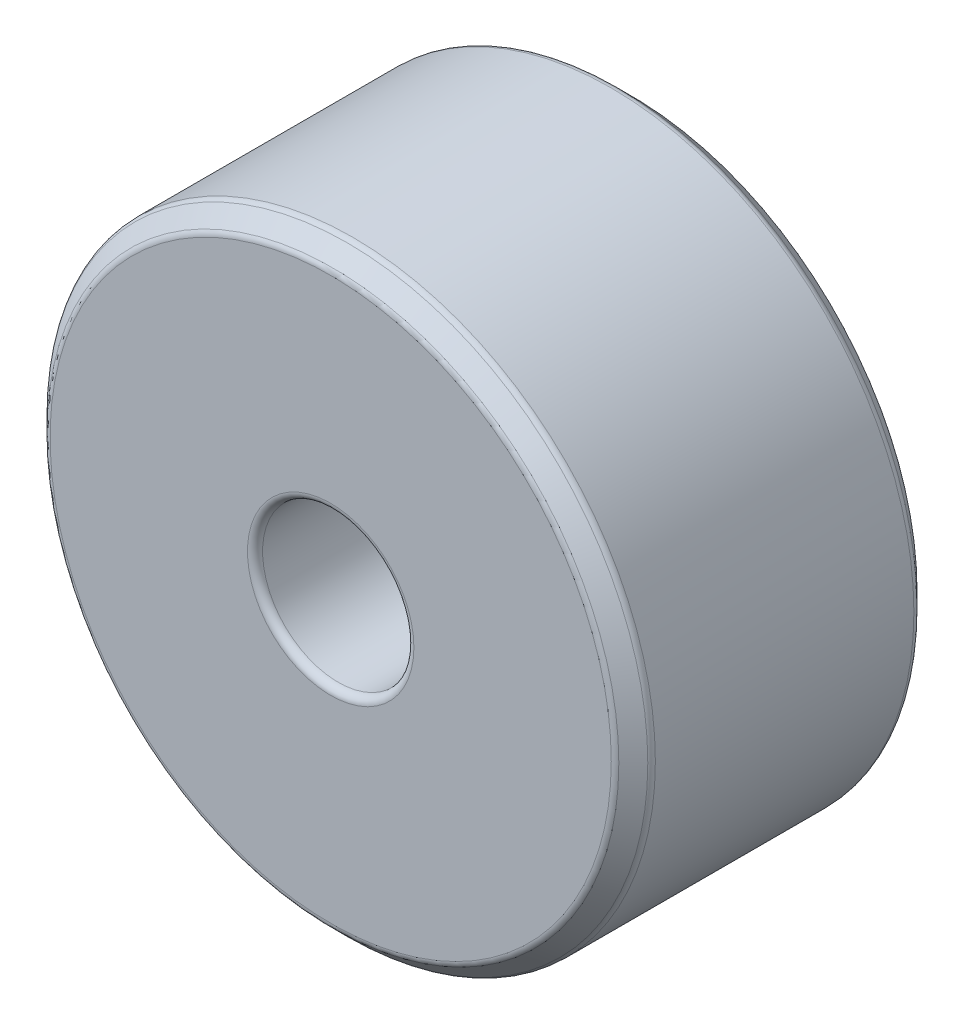
ISO-10303-21;
HEADER;
FILE_DESCRIPTION(('STEP AP214'),'2;1');
FILE_NAME('part.step','',(''),(''),'','','');
FILE_SCHEMA(('AUTOMOTIVE_DESIGN { 1 0 10303 214 1 1 1 1 }'));
ENDSEC;
DATA;
#1=APPLICATION_CONTEXT('core data for automotive mechanical design processes');
#2=APPLICATION_PROTOCOL_DEFINITION('international standard','automotive_design',2000,#1);
#3=PRODUCT_CONTEXT('',#1,'mechanical');
#4=PRODUCT('Part','Part','',(#3));
#5=PRODUCT_RELATED_PRODUCT_CATEGORY('part','',(#4));
#6=PRODUCT_DEFINITION_FORMATION('','',#4);
#7=PRODUCT_DEFINITION_CONTEXT('part definition',#1,'design');
#8=PRODUCT_DEFINITION('design','',#6,#7);
#9=PRODUCT_DEFINITION_SHAPE('','',#8);
#10=(LENGTH_UNIT() NAMED_UNIT(*) SI_UNIT(.MILLI.,.METRE.));
#11=(NAMED_UNIT(*) PLANE_ANGLE_UNIT() SI_UNIT($,.RADIAN.));
#12=(NAMED_UNIT(*) SI_UNIT($,.STERADIAN.) SOLID_ANGLE_UNIT());
#13=UNCERTAINTY_MEASURE_WITH_UNIT(LENGTH_MEASURE(1.E-05),#10,'distance_accuracy_value','');
#14=(GEOMETRIC_REPRESENTATION_CONTEXT(3) GLOBAL_UNCERTAINTY_ASSIGNED_CONTEXT((#13)) GLOBAL_UNIT_ASSIGNED_CONTEXT((#10,
#11,#12)) REPRESENTATION_CONTEXT('',''));
#15=CARTESIAN_POINT('',(0.,0.,0.));
#16=DIRECTION('',(0.,0.,1.));
#17=DIRECTION('',(1.,0.,0.));
#18=AXIS2_PLACEMENT_3D('',#15,#16,#17);
#19=CARTESIAN_POINT('',(0.,0.,4.));
#20=DIRECTION('',(0.,0.,1.));
#21=DIRECTION('',(1.,0.,0.));
#22=AXIS2_PLACEMENT_3D('',#19,#20,#21);
#23=PLANE('',#22);
#24=CARTESIAN_POINT('',(0.,0.,4.));
#25=DIRECTION('',(0.,0.,1.));
#26=DIRECTION('',(1.,0.,0.));
#27=AXIS2_PLACEMENT_3D('',#24,#25,#26);
#28=CIRCLE('',#27,3.70857864376269);
#29=CARTESIAN_POINT('',(3.70857864376269,0.,4.));
#30=VERTEX_POINT('',#29);
#31=EDGE_CURVE('E53',#30,#30,#28,.T.);
#32=ORIENTED_EDGE('',*,*,#31,.T.);
#33=EDGE_LOOP('',(#32));
#34=FACE_BOUND('',#33,.T.);
#35=CARTESIAN_POINT('',(0.,0.,4.));
#36=DIRECTION('',(0.,0.,1.));
#37=DIRECTION('',(1.,0.,0.));
#38=AXIS2_PLACEMENT_3D('',#35,#36,#37);
#39=CIRCLE('',#38,1.1);
#40=CARTESIAN_POINT('',(1.1,0.,4.));
#41=VERTEX_POINT('',#40);
#42=EDGE_CURVE('E56',#41,#41,#39,.F.);
#43=ORIENTED_EDGE('',*,*,#42,.T.);
#44=EDGE_LOOP('',(#43));
#45=FACE_BOUND('',#44,.T.);
#46=ADVANCED_FACE('F33',(#34,#45),#23,.T.);
#47=CARTESIAN_POINT('',(0.,0.,0.));
#48=DIRECTION('',(0.,0.,1.));
#49=DIRECTION('',(1.,0.,0.));
#50=AXIS2_PLACEMENT_3D('',#47,#48,#49);
#51=PLANE('',#50);
#52=CARTESIAN_POINT('',(0.,0.,0.));
#53=DIRECTION('',(0.,0.,1.));
#54=DIRECTION('',(1.,0.,0.));
#55=AXIS2_PLACEMENT_3D('',#52,#53,#54);
#56=CIRCLE('',#55,3.70857864376269);
#57=CARTESIAN_POINT('',(3.70857864376269,0.,0.));
#58=VERTEX_POINT('',#57);
#59=EDGE_CURVE('E71',#58,#58,#56,.F.);
#60=ORIENTED_EDGE('',*,*,#59,.T.);
#61=EDGE_LOOP('',(#60));
#62=FACE_BOUND('',#61,.T.);
#63=CARTESIAN_POINT('',(0.,0.,0.));
#64=DIRECTION('',(0.,0.,1.));
#65=DIRECTION('',(1.,0.,0.));
#66=AXIS2_PLACEMENT_3D('',#63,#64,#65);
#67=CIRCLE('',#66,1.1);
#68=CARTESIAN_POINT('',(1.1,0.,0.));
#69=VERTEX_POINT('',#68);
#70=EDGE_CURVE('E74',#69,#69,#67,.T.);
#71=ORIENTED_EDGE('',*,*,#70,.T.);
#72=EDGE_LOOP('',(#71));
#73=FACE_BOUND('',#72,.T.);
#74=ADVANCED_FACE('F78',(#62,#73),#51,.F.);
#75=CARTESIAN_POINT('',(0.,0.,4.));
#76=DIRECTION('',(0.,0.,-1.));
#77=DIRECTION('',(-1.,0.,0.));
#78=AXIS2_PLACEMENT_3D('',#75,#76,#77);
#79=CYLINDRICAL_SURFACE('',#78,4.);
#80=CARTESIAN_POINT('',(0.,0.,0.291421356237313));
#81=DIRECTION('',(0.,0.,-1.));
#82=DIRECTION('',(-1.,0.,0.));
#83=AXIS2_PLACEMENT_3D('',#80,#81,#82);
#84=CIRCLE('',#83,4.);
#85=CARTESIAN_POINT('',(-4.,0.,0.291421356237313));
#86=VERTEX_POINT('',#85);
#87=EDGE_CURVE('E59',#86,#86,#84,.F.);
#88=ORIENTED_EDGE('',*,*,#87,.T.);
#89=EDGE_LOOP('',(#88));
#90=FACE_BOUND('',#89,.T.);
#91=CARTESIAN_POINT('',(0.,0.,3.70857864376269));
#92=DIRECTION('',(0.,0.,1.));
#93=DIRECTION('',(1.,0.,0.));
#94=AXIS2_PLACEMENT_3D('',#91,#92,#93);
#95=CIRCLE('',#94,4.);
#96=CARTESIAN_POINT('',(4.,0.,3.70857864376269));
#97=VERTEX_POINT('',#96);
#98=EDGE_CURVE('E62',#97,#97,#95,.F.);
#99=ORIENTED_EDGE('',*,*,#98,.T.);
#100=EDGE_LOOP('',(#99));
#101=FACE_BOUND('',#100,.T.);
#102=ADVANCED_FACE('F98',(#90,#101),#79,.T.);
#103=CARTESIAN_POINT('',(0.,0.,4.));
#104=DIRECTION('',(0.,0.,-1.));
#105=DIRECTION('',(-1.,0.,0.));
#106=AXIS2_PLACEMENT_3D('',#103,#104,#105);
#107=CYLINDRICAL_SURFACE('',#106,1.);
#108=CARTESIAN_POINT('',(0.,0.,0.0999999999999998));
#109=DIRECTION('',(0.,0.,1.));
#110=DIRECTION('',(1.,0.,0.));
#111=AXIS2_PLACEMENT_3D('',#108,#109,#110);
#112=CIRCLE('',#111,1.);
#113=CARTESIAN_POINT('',(1.,0.,0.0999999999999998));
#114=VERTEX_POINT('',#113);
#115=EDGE_CURVE('E10',#114,#114,#112,.F.);
#116=ORIENTED_EDGE('',*,*,#115,.T.);
#117=EDGE_LOOP('',(#116));
#118=FACE_BOUND('',#117,.T.);
#119=CARTESIAN_POINT('',(0.,0.,3.9));
#120=DIRECTION('',(0.,0.,1.));
#121=DIRECTION('',(1.,0.,0.));
#122=AXIS2_PLACEMENT_3D('',#119,#120,#121);
#123=CIRCLE('',#122,1.);
#124=CARTESIAN_POINT('',(1.,0.,3.9));
#125=VERTEX_POINT('',#124);
#126=EDGE_CURVE('E40',#125,#125,#123,.T.);
#127=ORIENTED_EDGE('',*,*,#126,.T.);
#128=EDGE_LOOP('',(#127));
#129=FACE_BOUND('',#128,.T.);
#130=ADVANCED_FACE('F103',(#118,#129),#107,.F.);
#131=CARTESIAN_POINT('',(0.,0.,0.250000000000003));
#132=DIRECTION('',(0.,0.,1.));
#133=DIRECTION('',(1.,0.,0.));
#134=AXIS2_PLACEMENT_3D('',#131,#132,#133);
#135=CONICAL_SURFACE('',#134,4.,0.78539816339745);
#136=CARTESIAN_POINT('',(0.,0.,0.0292893218813441));
#137=DIRECTION('',(0.,0.,1.));
#138=DIRECTION('',(1.,0.,0.));
#139=AXIS2_PLACEMENT_3D('',#136,#137,#138);
#140=CIRCLE('',#139,3.77928932188134);
#141=CARTESIAN_POINT('',(3.77928932188134,0.,0.0292893218813441));
#142=VERTEX_POINT('',#141);
#143=EDGE_CURVE('E65',#142,#142,#140,.T.);
#144=ORIENTED_EDGE('',*,*,#143,.T.);
#145=EDGE_LOOP('',(#144));
#146=FACE_BOUND('',#145,.T.);
#147=CARTESIAN_POINT('',(0.,0.,0.220710678118658));
#148=DIRECTION('',(0.,0.,1.));
#149=DIRECTION('',(1.,0.,0.));
#150=AXIS2_PLACEMENT_3D('',#147,#148,#149);
#151=CIRCLE('',#150,3.97071067811865);
#152=CARTESIAN_POINT('',(3.97071067811865,0.,0.220710678118658));
#153=VERTEX_POINT('',#152);
#154=EDGE_CURVE('E68',#153,#153,#151,.F.);
#155=ORIENTED_EDGE('',*,*,#154,.T.);
#156=EDGE_LOOP('',(#155));
#157=FACE_BOUND('',#156,.T.);
#158=ADVANCED_FACE('F108',(#146,#157),#135,.T.);
#159=CARTESIAN_POINT('',(0.,0.,4.));
#160=DIRECTION('',(0.,0.,-1.));
#161=DIRECTION('',(-1.,0.,0.));
#162=AXIS2_PLACEMENT_3D('',#159,#160,#161);
#163=CONICAL_SURFACE('',#162,3.75,0.785398163397441);
#164=CARTESIAN_POINT('',(0.,0.,3.97071067811865));
#165=DIRECTION('',(0.,0.,1.));
#166=DIRECTION('',(1.,0.,0.));
#167=AXIS2_PLACEMENT_3D('',#164,#165,#166);
#168=CIRCLE('',#167,3.77928932188135);
#169=CARTESIAN_POINT('',(3.77928932188135,0.,3.97071067811865));
#170=VERTEX_POINT('',#169);
#171=EDGE_CURVE('E44',#170,#170,#168,.F.);
#172=ORIENTED_EDGE('',*,*,#171,.T.);
#173=EDGE_LOOP('',(#172));
#174=FACE_BOUND('',#173,.T.);
#175=CARTESIAN_POINT('',(0.,0.,3.77928932188134));
#176=DIRECTION('',(0.,0.,-1.));
#177=DIRECTION('',(-1.,0.,0.));
#178=AXIS2_PLACEMENT_3D('',#175,#176,#177);
#179=CIRCLE('',#178,3.97071067811866);
#180=CARTESIAN_POINT('',(-3.97071067811866,0.,3.77928932188134));
#181=VERTEX_POINT('',#180);
#182=EDGE_CURVE('E48',#181,#181,#179,.F.);
#183=ORIENTED_EDGE('',*,*,#182,.T.);
#184=EDGE_LOOP('',(#183));
#185=FACE_BOUND('',#184,.T.);
#186=ADVANCED_FACE('F111',(#174,#185),#163,.T.);
#187=CARTESIAN_POINT('',(0.,0.,0.1));
#188=DIRECTION('',(0.,0.,1.));
#189=DIRECTION('',(1.,0.,0.));
#190=AXIS2_PLACEMENT_3D('',#187,#188,#189);
#191=TOROIDAL_SURFACE('',#190,3.70857864376269,0.1);
#192=ORIENTED_EDGE('',*,*,#143,.F.);
#193=EDGE_LOOP('',(#192));
#194=FACE_BOUND('',#193,.T.);
#195=ORIENTED_EDGE('',*,*,#59,.F.);
#196=EDGE_LOOP('',(#195));
#197=FACE_BOUND('',#196,.T.);
#198=ADVANCED_FACE('F115',(#194,#197),#191,.T.);
#199=CARTESIAN_POINT('',(0.,0.,0.291421356237313));
#200=DIRECTION('',(0.,0.,-1.));
#201=DIRECTION('',(-1.,0.,0.));
#202=AXIS2_PLACEMENT_3D('',#199,#200,#201);
#203=TOROIDAL_SURFACE('',#202,3.9,0.1);
#204=ORIENTED_EDGE('',*,*,#154,.F.);
#205=EDGE_LOOP('',(#204));
#206=FACE_BOUND('',#205,.T.);
#207=ORIENTED_EDGE('',*,*,#87,.F.);
#208=EDGE_LOOP('',(#207));
#209=FACE_BOUND('',#208,.T.);
#210=ADVANCED_FACE('F119',(#206,#209),#203,.T.);
#211=CARTESIAN_POINT('',(0.,0.,3.9));
#212=DIRECTION('',(0.,0.,1.));
#213=DIRECTION('',(1.,0.,0.));
#214=AXIS2_PLACEMENT_3D('',#211,#212,#213);
#215=TOROIDAL_SURFACE('',#214,3.70857864376269,0.1);
#216=ORIENTED_EDGE('',*,*,#171,.F.);
#217=EDGE_LOOP('',(#216));
#218=FACE_BOUND('',#217,.T.);
#219=ORIENTED_EDGE('',*,*,#31,.F.);
#220=EDGE_LOOP('',(#219));
#221=FACE_BOUND('',#220,.T.);
#222=ADVANCED_FACE('F89',(#218,#221),#215,.T.);
#223=CARTESIAN_POINT('',(0.,0.,3.70857864376269));
#224=DIRECTION('',(0.,0.,1.));
#225=DIRECTION('',(1.,0.,0.));
#226=AXIS2_PLACEMENT_3D('',#223,#224,#225);
#227=TOROIDAL_SURFACE('',#226,3.9,0.1);
#228=ORIENTED_EDGE('',*,*,#182,.F.);
#229=EDGE_LOOP('',(#228));
#230=FACE_BOUND('',#229,.T.);
#231=ORIENTED_EDGE('',*,*,#98,.F.);
#232=EDGE_LOOP('',(#231));
#233=FACE_BOUND('',#232,.T.);
#234=ADVANCED_FACE('F82',(#230,#233),#227,.T.);
#235=CARTESIAN_POINT('',(0.,0.,0.0999999999999998));
#236=DIRECTION('',(0.,0.,1.));
#237=DIRECTION('',(1.,0.,0.));
#238=AXIS2_PLACEMENT_3D('',#235,#236,#237);
#239=TOROIDAL_SURFACE('',#238,1.1,0.1);
#240=ORIENTED_EDGE('',*,*,#115,.F.);
#241=EDGE_LOOP('',(#240));
#242=FACE_BOUND('',#241,.T.);
#243=ORIENTED_EDGE('',*,*,#70,.F.);
#244=EDGE_LOOP('',(#243));
#245=FACE_BOUND('',#244,.T.);
#246=ADVANCED_FACE('F80',(#242,#245),#239,.T.);
#247=CARTESIAN_POINT('',(0.,0.,3.9));
#248=DIRECTION('',(0.,0.,1.));
#249=DIRECTION('',(1.,0.,0.));
#250=AXIS2_PLACEMENT_3D('',#247,#248,#249);
#251=TOROIDAL_SURFACE('',#250,1.1,0.1);
#252=ORIENTED_EDGE('',*,*,#42,.F.);
#253=EDGE_LOOP('',(#252));
#254=FACE_BOUND('',#253,.T.);
#255=ORIENTED_EDGE('',*,*,#126,.F.);
#256=EDGE_LOOP('',(#255));
#257=FACE_BOUND('',#256,.T.);
#258=ADVANCED_FACE('F35',(#254,#257),#251,.T.);
#259=CLOSED_SHELL('',(#46,#74,#102,#130,#158,#186,#198,#210,#222,#234,#246,#258));
#260=MANIFOLD_SOLID_BREP('B2',#259);
#261=ADVANCED_BREP_SHAPE_REPRESENTATION('',(#18,#260),#14);
#262=SHAPE_DEFINITION_REPRESENTATION(#9,#261);
ENDSEC;
END-ISO-10303-21;
